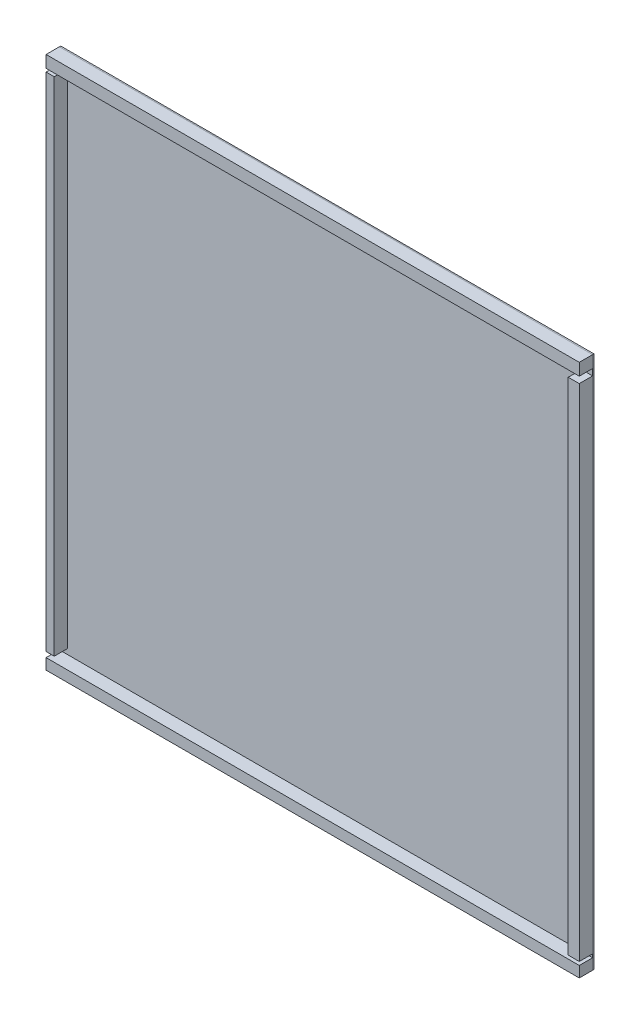
ISO-10303-21;
HEADER;
FILE_DESCRIPTION(('STEP AP214'),'2;1');
FILE_NAME('part.step','',(''),(''),'','','');
FILE_SCHEMA(('AUTOMOTIVE_DESIGN { 1 0 10303 214 1 1 1 1 }'));
ENDSEC;
DATA;
#1=APPLICATION_CONTEXT('core data for automotive mechanical design processes');
#2=APPLICATION_PROTOCOL_DEFINITION('international standard','automotive_design',2000,#1);
#3=PRODUCT_CONTEXT('',#1,'mechanical');
#4=PRODUCT('Part','Part','',(#3));
#5=PRODUCT_RELATED_PRODUCT_CATEGORY('part','',(#4));
#6=PRODUCT_DEFINITION_FORMATION('','',#4);
#7=PRODUCT_DEFINITION_CONTEXT('part definition',#1,'design');
#8=PRODUCT_DEFINITION('design','',#6,#7);
#9=PRODUCT_DEFINITION_SHAPE('','',#8);
#10=(LENGTH_UNIT() NAMED_UNIT(*) SI_UNIT(.MILLI.,.METRE.));
#11=(NAMED_UNIT(*) PLANE_ANGLE_UNIT() SI_UNIT($,.RADIAN.));
#12=(NAMED_UNIT(*) SI_UNIT($,.STERADIAN.) SOLID_ANGLE_UNIT());
#13=UNCERTAINTY_MEASURE_WITH_UNIT(LENGTH_MEASURE(1.E-05),#10,'distance_accuracy_value','');
#14=(GEOMETRIC_REPRESENTATION_CONTEXT(3) GLOBAL_UNCERTAINTY_ASSIGNED_CONTEXT((#13)) GLOBAL_UNIT_ASSIGNED_CONTEXT((#10,
#11,#12)) REPRESENTATION_CONTEXT('',''));
#15=CARTESIAN_POINT('',(0.,0.,0.));
#16=DIRECTION('',(0.,0.,1.));
#17=DIRECTION('',(1.,0.,0.));
#18=AXIS2_PLACEMENT_3D('',#15,#16,#17);
#19=CARTESIAN_POINT('',(-250.,3635.83819330735,110.));
#20=DIRECTION('',(1.,0.,0.));
#21=DIRECTION('',(0.,1.,0.));
#22=AXIS2_PLACEMENT_3D('',#19,#20,#21);
#23=PLANE('',#22);
#24=DIRECTION('',(0.,-1.,0.));
#25=VECTOR('',#24,1.);
#26=CARTESIAN_POINT('',(-250.,3635.83819330735,10.));
#27=LINE('',#26,#25);
#28=CARTESIAN_POINT('',(-250.,3635.83819330735,10.));
#29=VERTEX_POINT('',#28);
#30=CARTESIAN_POINT('',(-250.,-128.991405169124,10.));
#31=VERTEX_POINT('',#30);
#32=EDGE_CURVE('E111',#29,#31,#27,.T.);
#33=ORIENTED_EDGE('',*,*,#32,.T.);
#34=DIRECTION('',(0.,0.,-1.));
#35=VECTOR('',#34,1.);
#36=CARTESIAN_POINT('',(-250.,-128.991405169124,110.));
#37=LINE('',#36,#35);
#38=CARTESIAN_POINT('',(-250.,-128.991405169124,110.));
#39=VERTEX_POINT('',#38);
#40=EDGE_CURVE('E12',#39,#31,#37,.T.);
#41=ORIENTED_EDGE('',*,*,#40,.F.);
#42=DIRECTION('',(0.,-1.,0.));
#43=VECTOR('',#42,1.);
#44=CARTESIAN_POINT('',(-250.,3635.83819330735,110.));
#45=LINE('',#44,#43);
#46=CARTESIAN_POINT('',(-250.,3635.83819330735,110.));
#47=VERTEX_POINT('',#46);
#48=EDGE_CURVE('E99',#47,#39,#45,.T.);
#49=ORIENTED_EDGE('',*,*,#48,.F.);
#50=DIRECTION('',(0.,0.,-1.));
#51=VECTOR('',#50,1.);
#52=CARTESIAN_POINT('',(-250.,3635.83819330735,110.));
#53=LINE('',#52,#51);
#54=EDGE_CURVE('E107',#47,#29,#53,.T.);
#55=ORIENTED_EDGE('',*,*,#54,.T.);
#56=EDGE_LOOP('',(#33,#41,#49,#55));
#57=FACE_BOUND('',#56,.T.);
#58=ADVANCED_FACE('F48',(#57),#23,.F.);
#59=CARTESIAN_POINT('',(-250.,-128.991405169124,110.));
#60=DIRECTION('',(0.,1.,0.));
#61=DIRECTION('',(0.,0.,1.));
#62=AXIS2_PLACEMENT_3D('',#59,#60,#61);
#63=PLANE('',#62);
#64=DIRECTION('',(1.,0.,0.));
#65=VECTOR('',#64,1.);
#66=CARTESIAN_POINT('',(-250.,-128.991405169124,10.));
#67=LINE('',#66,#65);
#68=CARTESIAN_POINT('',(-188.991590886921,-128.991405169124,10.));
#69=VERTEX_POINT('',#68);
#70=EDGE_CURVE('E103',#31,#69,#67,.T.);
#71=ORIENTED_EDGE('',*,*,#70,.T.);
#72=DIRECTION('',(0.,0.,-1.));
#73=VECTOR('',#72,1.);
#74=CARTESIAN_POINT('',(-188.991590886921,-128.991405169124,110.));
#75=LINE('',#74,#73);
#76=CARTESIAN_POINT('',(-188.991590886921,-128.991405169124,110.));
#77=VERTEX_POINT('',#76);
#78=EDGE_CURVE('E56',#77,#69,#75,.T.);
#79=ORIENTED_EDGE('',*,*,#78,.F.);
#80=DIRECTION('',(1.,0.,0.));
#81=VECTOR('',#80,1.);
#82=CARTESIAN_POINT('',(-250.,-128.991405169124,110.));
#83=LINE('',#82,#81);
#84=EDGE_CURVE('E94',#39,#77,#83,.T.);
#85=ORIENTED_EDGE('',*,*,#84,.F.);
#86=ORIENTED_EDGE('',*,*,#40,.T.);
#87=EDGE_LOOP('',(#71,#79,#85,#86));
#88=FACE_BOUND('',#87,.T.);
#89=ADVANCED_FACE('F102',(#88),#63,.F.);
#90=CARTESIAN_POINT('',(-188.991590886921,3635.83819330735,110.));
#91=DIRECTION('',(-1.,0.,0.));
#92=DIRECTION('',(0.,-1.,0.));
#93=AXIS2_PLACEMENT_3D('',#90,#91,#92);
#94=PLANE('',#93);
#95=DIRECTION('',(0.,1.,0.));
#96=VECTOR('',#95,1.);
#97=CARTESIAN_POINT('',(-188.991590886921,3635.83819330735,10.));
#98=LINE('',#97,#96);
#99=CARTESIAN_POINT('',(-188.991590886921,3635.83819330735,10.));
#100=VERTEX_POINT('',#99);
#101=EDGE_CURVE('E81',#69,#100,#98,.T.);
#102=ORIENTED_EDGE('',*,*,#101,.T.);
#103=DIRECTION('',(0.,0.,-1.));
#104=VECTOR('',#103,1.);
#105=CARTESIAN_POINT('',(-188.991590886921,3635.83819330735,110.));
#106=LINE('',#105,#104);
#107=CARTESIAN_POINT('',(-188.991590886921,3635.83819330735,110.));
#108=VERTEX_POINT('',#107);
#109=EDGE_CURVE('E104',#108,#100,#106,.T.);
#110=ORIENTED_EDGE('',*,*,#109,.F.);
#111=DIRECTION('',(0.,1.,0.));
#112=VECTOR('',#111,1.);
#113=CARTESIAN_POINT('',(-188.991590886921,3635.83819330735,110.));
#114=LINE('',#113,#112);
#115=EDGE_CURVE('E97',#77,#108,#114,.T.);
#116=ORIENTED_EDGE('',*,*,#115,.F.);
#117=ORIENTED_EDGE('',*,*,#78,.T.);
#118=EDGE_LOOP('',(#102,#110,#116,#117));
#119=FACE_BOUND('',#118,.T.);
#120=ADVANCED_FACE('F105',(#119),#94,.F.);
#121=CARTESIAN_POINT('',(-250.,3635.83819330735,110.));
#122=DIRECTION('',(0.,-1.,0.));
#123=DIRECTION('',(0.,0.,-1.));
#124=AXIS2_PLACEMENT_3D('',#121,#122,#123);
#125=PLANE('',#124);
#126=DIRECTION('',(-1.,0.,0.));
#127=VECTOR('',#126,1.);
#128=CARTESIAN_POINT('',(-250.,3635.83819330735,10.));
#129=LINE('',#128,#127);
#130=EDGE_CURVE('E87',#100,#29,#129,.T.);
#131=ORIENTED_EDGE('',*,*,#130,.T.);
#132=ORIENTED_EDGE('',*,*,#54,.F.);
#133=DIRECTION('',(-1.,0.,0.));
#134=VECTOR('',#133,1.);
#135=CARTESIAN_POINT('',(-250.,3635.83819330735,110.));
#136=LINE('',#135,#134);
#137=EDGE_CURVE('E64',#108,#47,#136,.T.);
#138=ORIENTED_EDGE('',*,*,#137,.F.);
#139=ORIENTED_EDGE('',*,*,#109,.T.);
#140=EDGE_LOOP('',(#131,#132,#138,#139));
#141=FACE_BOUND('',#140,.T.);
#142=ADVANCED_FACE('F118',(#141),#125,.F.);
#143=CARTESIAN_POINT('',(0.,0.,110.));
#144=DIRECTION('',(0.,0.,1.));
#145=DIRECTION('',(1.,0.,0.));
#146=AXIS2_PLACEMENT_3D('',#143,#144,#145);
#147=PLANE('',#146);
#148=ORIENTED_EDGE('',*,*,#48,.T.);
#149=ORIENTED_EDGE('',*,*,#84,.T.);
#150=ORIENTED_EDGE('',*,*,#115,.T.);
#151=ORIENTED_EDGE('',*,*,#137,.T.);
#152=EDGE_LOOP('',(#148,#149,#150,#151));
#153=FACE_BOUND('',#152,.T.);
#154=ADVANCED_FACE('F95',(#153),#147,.T.);
#155=CARTESIAN_POINT('',(0.,0.,10.));
#156=DIRECTION('',(0.,0.,1.));
#157=DIRECTION('',(1.,0.,0.));
#158=AXIS2_PLACEMENT_3D('',#155,#156,#157);
#159=PLANE('',#158);
#160=ORIENTED_EDGE('',*,*,#32,.F.);
#161=ORIENTED_EDGE('',*,*,#130,.F.);
#162=ORIENTED_EDGE('',*,*,#101,.F.);
#163=ORIENTED_EDGE('',*,*,#70,.F.);
#164=EDGE_LOOP('',(#160,#161,#162,#163));
#165=FACE_BOUND('',#164,.T.);
#166=ADVANCED_FACE('F121',(#165),#159,.F.);
#167=CLOSED_SHELL('',(#58,#89,#120,#142,#154,#166));
#168=MANIFOLD_SOLID_BREP('B2',#167);
#169=CARTESIAN_POINT('',(3750.,3611.65891163353,110.));
#170=DIRECTION('',(-1.,0.,0.));
#171=DIRECTION('',(0.,0.,1.));
#172=AXIS2_PLACEMENT_3D('',#169,#170,#171);
#173=PLANE('',#172);
#174=DIRECTION('',(0.,1.,0.));
#175=VECTOR('',#174,1.);
#176=CARTESIAN_POINT('',(3750.,3611.65891163353,10.));
#177=LINE('',#176,#175);
#178=CARTESIAN_POINT('',(3750.,-142.873459851821,10.));
#179=VERTEX_POINT('',#178);
#180=CARTESIAN_POINT('',(3750.,3611.65891163353,10.));
#181=VERTEX_POINT('',#180);
#182=EDGE_CURVE('E245',#179,#181,#177,.T.);
#183=ORIENTED_EDGE('',*,*,#182,.T.);
#184=DIRECTION('',(0.,0.,-1.));
#185=VECTOR('',#184,1.);
#186=CARTESIAN_POINT('',(3750.,3611.65891163353,110.));
#187=LINE('',#186,#185);
#188=CARTESIAN_POINT('',(3750.,3611.65891163353,110.));
#189=VERTEX_POINT('',#188);
#190=EDGE_CURVE('E46',#189,#181,#187,.T.);
#191=ORIENTED_EDGE('',*,*,#190,.F.);
#192=DIRECTION('',(0.,1.,0.));
#193=VECTOR('',#192,1.);
#194=CARTESIAN_POINT('',(3750.,3611.65891163353,110.));
#195=LINE('',#194,#193);
#196=CARTESIAN_POINT('',(3750.,-142.873459851821,110.));
#197=VERTEX_POINT('',#196);
#198=EDGE_CURVE('E233',#197,#189,#195,.T.);
#199=ORIENTED_EDGE('',*,*,#198,.F.);
#200=DIRECTION('',(0.,0.,-1.));
#201=VECTOR('',#200,1.);
#202=CARTESIAN_POINT('',(3750.,-142.873459851821,110.));
#203=LINE('',#202,#201);
#204=EDGE_CURVE('E241',#197,#179,#203,.T.);
#205=ORIENTED_EDGE('',*,*,#204,.T.);
#206=EDGE_LOOP('',(#183,#191,#199,#205));
#207=FACE_BOUND('',#206,.T.);
#208=ADVANCED_FACE('F182',(#207),#173,.F.);
#209=CARTESIAN_POINT('',(3750.,3611.65891163353,110.));
#210=DIRECTION('',(0.,-1.,0.));
#211=DIRECTION('',(0.,0.,-1.));
#212=AXIS2_PLACEMENT_3D('',#209,#210,#211);
#213=PLANE('',#212);
#214=DIRECTION('',(-1.,0.,0.));
#215=VECTOR('',#214,1.);
#216=CARTESIAN_POINT('',(3750.,3611.65891163353,10.));
#217=LINE('',#216,#215);
#218=CARTESIAN_POINT('',(3667.29530272277,3611.65891163353,10.));
#219=VERTEX_POINT('',#218);
#220=EDGE_CURVE('E237',#181,#219,#217,.T.);
#221=ORIENTED_EDGE('',*,*,#220,.T.);
#222=DIRECTION('',(0.,0.,-1.));
#223=VECTOR('',#222,1.);
#224=CARTESIAN_POINT('',(3667.29530272277,3611.65891163353,110.));
#225=LINE('',#224,#223);
#226=CARTESIAN_POINT('',(3667.29530272277,3611.65891163353,110.));
#227=VERTEX_POINT('',#226);
#228=EDGE_CURVE('E190',#227,#219,#225,.T.);
#229=ORIENTED_EDGE('',*,*,#228,.F.);
#230=DIRECTION('',(-1.,0.,0.));
#231=VECTOR('',#230,1.);
#232=CARTESIAN_POINT('',(3750.,3611.65891163353,110.));
#233=LINE('',#232,#231);
#234=EDGE_CURVE('E228',#189,#227,#233,.T.);
#235=ORIENTED_EDGE('',*,*,#234,.F.);
#236=ORIENTED_EDGE('',*,*,#190,.T.);
#237=EDGE_LOOP('',(#221,#229,#235,#236));
#238=FACE_BOUND('',#237,.T.);
#239=ADVANCED_FACE('F236',(#238),#213,.F.);
#240=CARTESIAN_POINT('',(3667.29530272277,3611.65891163353,110.));
#241=DIRECTION('',(1.,0.,0.));
#242=DIRECTION('',(0.,1.,0.));
#243=AXIS2_PLACEMENT_3D('',#240,#241,#242);
#244=PLANE('',#243);
#245=DIRECTION('',(0.,-1.,0.));
#246=VECTOR('',#245,1.);
#247=CARTESIAN_POINT('',(3667.29530272277,3611.65891163353,10.));
#248=LINE('',#247,#246);
#249=CARTESIAN_POINT('',(3667.29530272277,-142.873459851821,10.));
#250=VERTEX_POINT('',#249);
#251=EDGE_CURVE('E215',#219,#250,#248,.T.);
#252=ORIENTED_EDGE('',*,*,#251,.T.);
#253=DIRECTION('',(0.,0.,-1.));
#254=VECTOR('',#253,1.);
#255=CARTESIAN_POINT('',(3667.29530272277,-142.873459851821,110.));
#256=LINE('',#255,#254);
#257=CARTESIAN_POINT('',(3667.29530272277,-142.873459851821,110.));
#258=VERTEX_POINT('',#257);
#259=EDGE_CURVE('E238',#258,#250,#256,.T.);
#260=ORIENTED_EDGE('',*,*,#259,.F.);
#261=DIRECTION('',(0.,-1.,0.));
#262=VECTOR('',#261,1.);
#263=CARTESIAN_POINT('',(3667.29530272277,3611.65891163353,110.));
#264=LINE('',#263,#262);
#265=EDGE_CURVE('E231',#227,#258,#264,.T.);
#266=ORIENTED_EDGE('',*,*,#265,.F.);
#267=ORIENTED_EDGE('',*,*,#228,.T.);
#268=EDGE_LOOP('',(#252,#260,#266,#267));
#269=FACE_BOUND('',#268,.T.);
#270=ADVANCED_FACE('F239',(#269),#244,.F.);
#271=CARTESIAN_POINT('',(3750.,-142.873459851821,110.));
#272=DIRECTION('',(0.,1.,0.));
#273=DIRECTION('',(0.,0.,1.));
#274=AXIS2_PLACEMENT_3D('',#271,#272,#273);
#275=PLANE('',#274);
#276=DIRECTION('',(1.,0.,0.));
#277=VECTOR('',#276,1.);
#278=CARTESIAN_POINT('',(3750.,-142.873459851821,10.));
#279=LINE('',#278,#277);
#280=EDGE_CURVE('E221',#250,#179,#279,.T.);
#281=ORIENTED_EDGE('',*,*,#280,.T.);
#282=ORIENTED_EDGE('',*,*,#204,.F.);
#283=DIRECTION('',(1.,0.,0.));
#284=VECTOR('',#283,1.);
#285=CARTESIAN_POINT('',(3750.,-142.873459851821,110.));
#286=LINE('',#285,#284);
#287=EDGE_CURVE('E198',#258,#197,#286,.T.);
#288=ORIENTED_EDGE('',*,*,#287,.F.);
#289=ORIENTED_EDGE('',*,*,#259,.T.);
#290=EDGE_LOOP('',(#281,#282,#288,#289));
#291=FACE_BOUND('',#290,.T.);
#292=ADVANCED_FACE('F252',(#291),#275,.F.);
#293=CARTESIAN_POINT('',(0.,0.,110.));
#294=DIRECTION('',(0.,0.,-1.));
#295=DIRECTION('',(-1.,0.,0.));
#296=AXIS2_PLACEMENT_3D('',#293,#294,#295);
#297=PLANE('',#296);
#298=ORIENTED_EDGE('',*,*,#198,.T.);
#299=ORIENTED_EDGE('',*,*,#234,.T.);
#300=ORIENTED_EDGE('',*,*,#265,.T.);
#301=ORIENTED_EDGE('',*,*,#287,.T.);
#302=EDGE_LOOP('',(#298,#299,#300,#301));
#303=FACE_BOUND('',#302,.T.);
#304=ADVANCED_FACE('F229',(#303),#297,.F.);
#305=CARTESIAN_POINT('',(0.,0.,10.));
#306=DIRECTION('',(0.,0.,-1.));
#307=DIRECTION('',(-1.,0.,0.));
#308=AXIS2_PLACEMENT_3D('',#305,#306,#307);
#309=PLANE('',#308);
#310=ORIENTED_EDGE('',*,*,#182,.F.);
#311=ORIENTED_EDGE('',*,*,#280,.F.);
#312=ORIENTED_EDGE('',*,*,#251,.F.);
#313=ORIENTED_EDGE('',*,*,#220,.F.);
#314=EDGE_LOOP('',(#310,#311,#312,#313));
#315=FACE_BOUND('',#314,.T.);
#316=ADVANCED_FACE('F255',(#315),#309,.T.);
#317=CLOSED_SHELL('',(#208,#239,#270,#292,#304,#316));
#318=MANIFOLD_SOLID_BREP('B6',#317);
#319=CARTESIAN_POINT('',(3750.,-250.,110.));
#320=DIRECTION('',(-1.,0.,0.));
#321=DIRECTION('',(0.,0.,1.));
#322=AXIS2_PLACEMENT_3D('',#319,#320,#321);
#323=PLANE('',#322);
#324=DIRECTION('',(0.,1.,0.));
#325=VECTOR('',#324,1.);
#326=CARTESIAN_POINT('',(3750.,-250.,10.));
#327=LINE('',#326,#325);
#328=CARTESIAN_POINT('',(3750.,-250.,10.));
#329=VERTEX_POINT('',#328);
#330=CARTESIAN_POINT('',(3750.,-168.414891018658,10.));
#331=VERTEX_POINT('',#330);
#332=EDGE_CURVE('E379',#329,#331,#327,.T.);
#333=ORIENTED_EDGE('',*,*,#332,.T.);
#334=DIRECTION('',(0.,0.,-1.));
#335=VECTOR('',#334,1.);
#336=CARTESIAN_POINT('',(3750.,-168.414891018658,110.));
#337=LINE('',#336,#335);
#338=CARTESIAN_POINT('',(3750.,-168.414891018658,110.));
#339=VERTEX_POINT('',#338);
#340=EDGE_CURVE('E180',#339,#331,#337,.T.);
#341=ORIENTED_EDGE('',*,*,#340,.F.);
#342=DIRECTION('',(0.,1.,0.));
#343=VECTOR('',#342,1.);
#344=CARTESIAN_POINT('',(3750.,-250.,110.));
#345=LINE('',#344,#343);
#346=CARTESIAN_POINT('',(3750.,-250.,110.));
#347=VERTEX_POINT('',#346);
#348=EDGE_CURVE('E367',#347,#339,#345,.T.);
#349=ORIENTED_EDGE('',*,*,#348,.F.);
#350=DIRECTION('',(0.,0.,-1.));
#351=VECTOR('',#350,1.);
#352=CARTESIAN_POINT('',(3750.,-250.,110.));
#353=LINE('',#352,#351);
#354=EDGE_CURVE('E375',#347,#329,#353,.T.);
#355=ORIENTED_EDGE('',*,*,#354,.T.);
#356=EDGE_LOOP('',(#333,#341,#349,#355));
#357=FACE_BOUND('',#356,.T.);
#358=ADVANCED_FACE('F316',(#357),#323,.F.);
#359=CARTESIAN_POINT('',(3750.,-168.414891018658,110.));
#360=DIRECTION('',(0.,-1.,0.));
#361=DIRECTION('',(1.,0.,0.));
#362=AXIS2_PLACEMENT_3D('',#359,#360,#361);
#363=PLANE('',#362);
#364=DIRECTION('',(-1.,0.,0.));
#365=VECTOR('',#364,1.);
#366=CARTESIAN_POINT('',(3750.,-168.414891018658,10.));
#367=LINE('',#366,#365);
#368=CARTESIAN_POINT('',(-250.,-168.414891018658,10.));
#369=VERTEX_POINT('',#368);
#370=EDGE_CURVE('E371',#331,#369,#367,.T.);
#371=ORIENTED_EDGE('',*,*,#370,.T.);
#372=DIRECTION('',(0.,0.,-1.));
#373=VECTOR('',#372,1.);
#374=CARTESIAN_POINT('',(-250.,-168.414891018658,110.));
#375=LINE('',#374,#373);
#376=CARTESIAN_POINT('',(-250.,-168.414891018658,110.));
#377=VERTEX_POINT('',#376);
#378=EDGE_CURVE('E324',#377,#369,#375,.T.);
#379=ORIENTED_EDGE('',*,*,#378,.F.);
#380=DIRECTION('',(-1.,0.,0.));
#381=VECTOR('',#380,1.);
#382=CARTESIAN_POINT('',(3750.,-168.414891018658,110.));
#383=LINE('',#382,#381);
#384=EDGE_CURVE('E362',#339,#377,#383,.T.);
#385=ORIENTED_EDGE('',*,*,#384,.F.);
#386=ORIENTED_EDGE('',*,*,#340,.T.);
#387=EDGE_LOOP('',(#371,#379,#385,#386));
#388=FACE_BOUND('',#387,.T.);
#389=ADVANCED_FACE('F370',(#388),#363,.F.);
#390=CARTESIAN_POINT('',(-250.,-250.,110.));
#391=DIRECTION('',(1.,0.,0.));
#392=DIRECTION('',(0.,1.,0.));
#393=AXIS2_PLACEMENT_3D('',#390,#391,#392);
#394=PLANE('',#393);
#395=DIRECTION('',(0.,-1.,0.));
#396=VECTOR('',#395,1.);
#397=CARTESIAN_POINT('',(-250.,-250.,10.));
#398=LINE('',#397,#396);
#399=CARTESIAN_POINT('',(-250.,-250.,10.));
#400=VERTEX_POINT('',#399);
#401=EDGE_CURVE('E349',#369,#400,#398,.T.);
#402=ORIENTED_EDGE('',*,*,#401,.T.);
#403=DIRECTION('',(0.,0.,-1.));
#404=VECTOR('',#403,1.);
#405=CARTESIAN_POINT('',(-250.,-250.,110.));
#406=LINE('',#405,#404);
#407=CARTESIAN_POINT('',(-250.,-250.,110.));
#408=VERTEX_POINT('',#407);
#409=EDGE_CURVE('E372',#408,#400,#406,.T.);
#410=ORIENTED_EDGE('',*,*,#409,.F.);
#411=DIRECTION('',(0.,-1.,0.));
#412=VECTOR('',#411,1.);
#413=CARTESIAN_POINT('',(-250.,-250.,110.));
#414=LINE('',#413,#412);
#415=EDGE_CURVE('E365',#377,#408,#414,.T.);
#416=ORIENTED_EDGE('',*,*,#415,.F.);
#417=ORIENTED_EDGE('',*,*,#378,.T.);
#418=EDGE_LOOP('',(#402,#410,#416,#417));
#419=FACE_BOUND('',#418,.T.);
#420=ADVANCED_FACE('F373',(#419),#394,.F.);
#421=CARTESIAN_POINT('',(3750.,-250.,110.));
#422=DIRECTION('',(0.,1.,0.));
#423=DIRECTION('',(-1.,0.,0.));
#424=AXIS2_PLACEMENT_3D('',#421,#422,#423);
#425=PLANE('',#424);
#426=DIRECTION('',(1.,0.,0.));
#427=VECTOR('',#426,1.);
#428=CARTESIAN_POINT('',(3750.,-250.,10.));
#429=LINE('',#428,#427);
#430=EDGE_CURVE('E355',#400,#329,#429,.T.);
#431=ORIENTED_EDGE('',*,*,#430,.T.);
#432=ORIENTED_EDGE('',*,*,#354,.F.);
#433=DIRECTION('',(1.,0.,0.));
#434=VECTOR('',#433,1.);
#435=CARTESIAN_POINT('',(3750.,-250.,110.));
#436=LINE('',#435,#434);
#437=EDGE_CURVE('E332',#408,#347,#436,.T.);
#438=ORIENTED_EDGE('',*,*,#437,.F.);
#439=ORIENTED_EDGE('',*,*,#409,.T.);
#440=EDGE_LOOP('',(#431,#432,#438,#439));
#441=FACE_BOUND('',#440,.T.);
#442=ADVANCED_FACE('F386',(#441),#425,.F.);
#443=CARTESIAN_POINT('',(0.,0.,110.));
#444=DIRECTION('',(0.,0.,1.));
#445=DIRECTION('',(1.,0.,0.));
#446=AXIS2_PLACEMENT_3D('',#443,#444,#445);
#447=PLANE('',#446);
#448=ORIENTED_EDGE('',*,*,#348,.T.);
#449=ORIENTED_EDGE('',*,*,#384,.T.);
#450=ORIENTED_EDGE('',*,*,#415,.T.);
#451=ORIENTED_EDGE('',*,*,#437,.T.);
#452=EDGE_LOOP('',(#448,#449,#450,#451));
#453=FACE_BOUND('',#452,.T.);
#454=ADVANCED_FACE('F363',(#453),#447,.T.);
#455=CARTESIAN_POINT('',(0.,0.,10.));
#456=DIRECTION('',(0.,0.,1.));
#457=DIRECTION('',(1.,0.,0.));
#458=AXIS2_PLACEMENT_3D('',#455,#456,#457);
#459=PLANE('',#458);
#460=ORIENTED_EDGE('',*,*,#332,.F.);
#461=ORIENTED_EDGE('',*,*,#430,.F.);
#462=ORIENTED_EDGE('',*,*,#401,.F.);
#463=ORIENTED_EDGE('',*,*,#370,.F.);
#464=EDGE_LOOP('',(#460,#461,#462,#463));
#465=FACE_BOUND('',#464,.T.);
#466=ADVANCED_FACE('F389',(#465),#459,.F.);
#467=CLOSED_SHELL('',(#358,#389,#420,#442,#454,#466));
#468=MANIFOLD_SOLID_BREP('B40',#467);
#469=CARTESIAN_POINT('',(-250.,3750.,110.));
#470=DIRECTION('',(1.,0.,0.));
#471=DIRECTION('',(0.,0.,-1.));
#472=AXIS2_PLACEMENT_3D('',#469,#470,#471);
#473=PLANE('',#472);
#474=DIRECTION('',(0.,-1.,0.));
#475=VECTOR('',#474,1.);
#476=CARTESIAN_POINT('',(-250.,3750.,10.));
#477=LINE('',#476,#475);
#478=CARTESIAN_POINT('',(-250.,3750.,10.));
#479=VERTEX_POINT('',#478);
#480=CARTESIAN_POINT('',(-250.,3659.87592745532,10.));
#481=VERTEX_POINT('',#480);
#482=EDGE_CURVE('E513',#479,#481,#477,.T.);
#483=ORIENTED_EDGE('',*,*,#482,.T.);
#484=DIRECTION('',(0.,0.,-1.));
#485=VECTOR('',#484,1.);
#486=CARTESIAN_POINT('',(-250.,3659.87592745532,110.));
#487=LINE('',#486,#485);
#488=CARTESIAN_POINT('',(-250.,3659.87592745532,110.));
#489=VERTEX_POINT('',#488);
#490=EDGE_CURVE('E314',#489,#481,#487,.T.);
#491=ORIENTED_EDGE('',*,*,#490,.F.);
#492=DIRECTION('',(0.,-1.,0.));
#493=VECTOR('',#492,1.);
#494=CARTESIAN_POINT('',(-250.,3750.,110.));
#495=LINE('',#494,#493);
#496=CARTESIAN_POINT('',(-250.,3750.,110.));
#497=VERTEX_POINT('',#496);
#498=EDGE_CURVE('E501',#497,#489,#495,.T.);
#499=ORIENTED_EDGE('',*,*,#498,.F.);
#500=DIRECTION('',(0.,0.,-1.));
#501=VECTOR('',#500,1.);
#502=CARTESIAN_POINT('',(-250.,3750.,110.));
#503=LINE('',#502,#501);
#504=EDGE_CURVE('E509',#497,#479,#503,.T.);
#505=ORIENTED_EDGE('',*,*,#504,.T.);
#506=EDGE_LOOP('',(#483,#491,#499,#505));
#507=FACE_BOUND('',#506,.T.);
#508=ADVANCED_FACE('F450',(#507),#473,.F.);
#509=CARTESIAN_POINT('',(-250.,3659.87592745532,110.));
#510=DIRECTION('',(0.,1.,0.));
#511=DIRECTION('',(0.,0.,1.));
#512=AXIS2_PLACEMENT_3D('',#509,#510,#511);
#513=PLANE('',#512);
#514=DIRECTION('',(1.,0.,0.));
#515=VECTOR('',#514,1.);
#516=CARTESIAN_POINT('',(-250.,3659.87592745532,10.));
#517=LINE('',#516,#515);
#518=CARTESIAN_POINT('',(3750.,3659.87592745532,10.));
#519=VERTEX_POINT('',#518);
#520=EDGE_CURVE('E505',#481,#519,#517,.T.);
#521=ORIENTED_EDGE('',*,*,#520,.T.);
#522=DIRECTION('',(0.,0.,-1.));
#523=VECTOR('',#522,1.);
#524=CARTESIAN_POINT('',(3750.,3659.87592745532,110.));
#525=LINE('',#524,#523);
#526=CARTESIAN_POINT('',(3750.,3659.87592745532,110.));
#527=VERTEX_POINT('',#526);
#528=EDGE_CURVE('E458',#527,#519,#525,.T.);
#529=ORIENTED_EDGE('',*,*,#528,.F.);
#530=DIRECTION('',(1.,0.,0.));
#531=VECTOR('',#530,1.);
#532=CARTESIAN_POINT('',(-250.,3659.87592745532,110.));
#533=LINE('',#532,#531);
#534=EDGE_CURVE('E496',#489,#527,#533,.T.);
#535=ORIENTED_EDGE('',*,*,#534,.F.);
#536=ORIENTED_EDGE('',*,*,#490,.T.);
#537=EDGE_LOOP('',(#521,#529,#535,#536));
#538=FACE_BOUND('',#537,.T.);
#539=ADVANCED_FACE('F504',(#538),#513,.F.);
#540=CARTESIAN_POINT('',(3750.,3750.,110.));
#541=DIRECTION('',(-1.,0.,0.));
#542=DIRECTION('',(0.,0.,1.));
#543=AXIS2_PLACEMENT_3D('',#540,#541,#542);
#544=PLANE('',#543);
#545=DIRECTION('',(0.,1.,0.));
#546=VECTOR('',#545,1.);
#547=CARTESIAN_POINT('',(3750.,3750.,10.));
#548=LINE('',#547,#546);
#549=CARTESIAN_POINT('',(3750.,3750.,10.));
#550=VERTEX_POINT('',#549);
#551=EDGE_CURVE('E483',#519,#550,#548,.T.);
#552=ORIENTED_EDGE('',*,*,#551,.T.);
#553=DIRECTION('',(0.,0.,-1.));
#554=VECTOR('',#553,1.);
#555=CARTESIAN_POINT('',(3750.,3750.,110.));
#556=LINE('',#555,#554);
#557=CARTESIAN_POINT('',(3750.,3750.,110.));
#558=VERTEX_POINT('',#557);
#559=EDGE_CURVE('E506',#558,#550,#556,.T.);
#560=ORIENTED_EDGE('',*,*,#559,.F.);
#561=DIRECTION('',(0.,1.,0.));
#562=VECTOR('',#561,1.);
#563=CARTESIAN_POINT('',(3750.,3750.,110.));
#564=LINE('',#563,#562);
#565=EDGE_CURVE('E499',#527,#558,#564,.T.);
#566=ORIENTED_EDGE('',*,*,#565,.F.);
#567=ORIENTED_EDGE('',*,*,#528,.T.);
#568=EDGE_LOOP('',(#552,#560,#566,#567));
#569=FACE_BOUND('',#568,.T.);
#570=ADVANCED_FACE('F507',(#569),#544,.F.);
#571=CARTESIAN_POINT('',(-250.,3750.,110.));
#572=DIRECTION('',(0.,-1.,0.));
#573=DIRECTION('',(0.,0.,-1.));
#574=AXIS2_PLACEMENT_3D('',#571,#572,#573);
#575=PLANE('',#574);
#576=DIRECTION('',(-1.,0.,0.));
#577=VECTOR('',#576,1.);
#578=CARTESIAN_POINT('',(-250.,3750.,10.));
#579=LINE('',#578,#577);
#580=EDGE_CURVE('E489',#550,#479,#579,.T.);
#581=ORIENTED_EDGE('',*,*,#580,.T.);
#582=ORIENTED_EDGE('',*,*,#504,.F.);
#583=DIRECTION('',(-1.,0.,0.));
#584=VECTOR('',#583,1.);
#585=CARTESIAN_POINT('',(-250.,3750.,110.));
#586=LINE('',#585,#584);
#587=EDGE_CURVE('E466',#558,#497,#586,.T.);
#588=ORIENTED_EDGE('',*,*,#587,.F.);
#589=ORIENTED_EDGE('',*,*,#559,.T.);
#590=EDGE_LOOP('',(#581,#582,#588,#589));
#591=FACE_BOUND('',#590,.T.);
#592=ADVANCED_FACE('F520',(#591),#575,.F.);
#593=CARTESIAN_POINT('',(0.,0.,110.));
#594=DIRECTION('',(0.,0.,1.));
#595=DIRECTION('',(1.,0.,0.));
#596=AXIS2_PLACEMENT_3D('',#593,#594,#595);
#597=PLANE('',#596);
#598=ORIENTED_EDGE('',*,*,#498,.T.);
#599=ORIENTED_EDGE('',*,*,#534,.T.);
#600=ORIENTED_EDGE('',*,*,#565,.T.);
#601=ORIENTED_EDGE('',*,*,#587,.T.);
#602=EDGE_LOOP('',(#598,#599,#600,#601));
#603=FACE_BOUND('',#602,.T.);
#604=ADVANCED_FACE('F497',(#603),#597,.T.);
#605=CARTESIAN_POINT('',(0.,0.,10.));
#606=DIRECTION('',(0.,0.,1.));
#607=DIRECTION('',(1.,0.,0.));
#608=AXIS2_PLACEMENT_3D('',#605,#606,#607);
#609=PLANE('',#608);
#610=ORIENTED_EDGE('',*,*,#482,.F.);
#611=ORIENTED_EDGE('',*,*,#580,.F.);
#612=ORIENTED_EDGE('',*,*,#551,.F.);
#613=ORIENTED_EDGE('',*,*,#520,.F.);
#614=EDGE_LOOP('',(#610,#611,#612,#613));
#615=FACE_BOUND('',#614,.T.);
#616=ADVANCED_FACE('F523',(#615),#609,.F.);
#617=CLOSED_SHELL('',(#508,#539,#570,#592,#604,#616));
#618=MANIFOLD_SOLID_BREP('B174',#617);
#619=CARTESIAN_POINT('',(0.,0.,0.));
#620=DIRECTION('',(0.,0.,1.));
#621=DIRECTION('',(1.,0.,0.));
#622=AXIS2_PLACEMENT_3D('',#619,#620,#621);
#623=PLANE('',#622);
#624=DIRECTION('',(0.,1.,0.));
#625=VECTOR('',#624,1.);
#626=CARTESIAN_POINT('',(-250.,3750.,0.));
#627=LINE('',#626,#625);
#628=CARTESIAN_POINT('',(-250.,-250.,-1.13686837721616E-10));
#629=VERTEX_POINT('',#628);
#630=CARTESIAN_POINT('',(-250.,3750.,-1.13686837721616E-10));
#631=VERTEX_POINT('',#630);
#632=EDGE_CURVE('E629',#629,#631,#627,.T.);
#633=ORIENTED_EDGE('',*,*,#632,.T.);
#634=DIRECTION('',(-1.,0.,0.));
#635=VECTOR('',#634,1.);
#636=CARTESIAN_POINT('',(-250.,3750.,0.));
#637=LINE('',#636,#635);
#638=CARTESIAN_POINT('',(3750.,3750.,-1.13686837721616E-10));
#639=VERTEX_POINT('',#638);
#640=EDGE_CURVE('E644',#639,#631,#637,.T.);
#641=ORIENTED_EDGE('',*,*,#640,.F.);
#642=DIRECTION('',(0.,1.,0.));
#643=VECTOR('',#642,1.);
#644=CARTESIAN_POINT('',(3750.,3750.,0.));
#645=LINE('',#644,#643);
#646=CARTESIAN_POINT('',(3750.,-250.,-1.13686837721616E-10));
#647=VERTEX_POINT('',#646);
#648=EDGE_CURVE('E630',#647,#639,#645,.T.);
#649=ORIENTED_EDGE('',*,*,#648,.F.);
#650=DIRECTION('',(1.,0.,0.));
#651=VECTOR('',#650,1.);
#652=CARTESIAN_POINT('',(-250.,-250.,0.));
#653=LINE('',#652,#651);
#654=EDGE_CURVE('E627',#629,#647,#653,.T.);
#655=ORIENTED_EDGE('',*,*,#654,.F.);
#656=EDGE_LOOP('',(#633,#641,#649,#655));
#657=FACE_BOUND('',#656,.T.);
#658=ADVANCED_FACE('F583',(#657),#623,.F.);
#659=CARTESIAN_POINT('',(3750.,3750.,-500000.));
#660=DIRECTION('',(1.,0.,0.));
#661=DIRECTION('',(0.,1.,0.));
#662=AXIS2_PLACEMENT_3D('',#659,#660,#661);
#663=PLANE('',#662);
#664=DIRECTION('',(0.,0.,1.));
#665=VECTOR('',#664,1.);
#666=CARTESIAN_POINT('',(3750.,-250.,-500000.));
#667=LINE('',#666,#665);
#668=CARTESIAN_POINT('',(3750.,-250.,10.));
#669=VERTEX_POINT('',#668);
#670=EDGE_CURVE('E643',#647,#669,#667,.T.);
#671=ORIENTED_EDGE('',*,*,#670,.F.);
#672=ORIENTED_EDGE('',*,*,#648,.T.);
#673=DIRECTION('',(0.,0.,1.));
#674=VECTOR('',#673,1.);
#675=CARTESIAN_POINT('',(3750.,3750.,-500000.));
#676=LINE('',#675,#674);
#677=CARTESIAN_POINT('',(3750.,3750.,10.));
#678=VERTEX_POINT('',#677);
#679=EDGE_CURVE('E607',#639,#678,#676,.T.);
#680=ORIENTED_EDGE('',*,*,#679,.T.);
#681=DIRECTION('',(0.,1.,0.));
#682=VECTOR('',#681,1.);
#683=CARTESIAN_POINT('',(3750.,3750.,10.));
#684=LINE('',#683,#682);
#685=EDGE_CURVE('E649',#669,#678,#684,.T.);
#686=ORIENTED_EDGE('',*,*,#685,.F.);
#687=EDGE_LOOP('',(#671,#672,#680,#686));
#688=FACE_BOUND('',#687,.T.);
#689=ADVANCED_FACE('F656',(#688),#663,.T.);
#690=CARTESIAN_POINT('',(0.,0.,10.));
#691=DIRECTION('',(0.,0.,1.));
#692=DIRECTION('',(1.,0.,0.));
#693=AXIS2_PLACEMENT_3D('',#690,#691,#692);
#694=PLANE('',#693);
#695=DIRECTION('',(0.,-1.,0.));
#696=VECTOR('',#695,1.);
#697=CARTESIAN_POINT('',(-250.,3750.,10.));
#698=LINE('',#697,#696);
#699=CARTESIAN_POINT('',(-250.,3750.,10.));
#700=VERTEX_POINT('',#699);
#701=CARTESIAN_POINT('',(-250.,-250.,10.));
#702=VERTEX_POINT('',#701);
#703=EDGE_CURVE('E448',#700,#702,#698,.T.);
#704=ORIENTED_EDGE('',*,*,#703,.T.);
#705=DIRECTION('',(1.,0.,0.));
#706=VECTOR('',#705,1.);
#707=CARTESIAN_POINT('',(-250.,-250.,10.));
#708=LINE('',#707,#706);
#709=EDGE_CURVE('E592',#702,#669,#708,.T.);
#710=ORIENTED_EDGE('',*,*,#709,.T.);
#711=ORIENTED_EDGE('',*,*,#685,.T.);
#712=DIRECTION('',(-1.,0.,0.));
#713=VECTOR('',#712,1.);
#714=CARTESIAN_POINT('',(-250.,3750.,10.));
#715=LINE('',#714,#713);
#716=EDGE_CURVE('E648',#678,#700,#715,.T.);
#717=ORIENTED_EDGE('',*,*,#716,.T.);
#718=EDGE_LOOP('',(#704,#710,#711,#717));
#719=FACE_BOUND('',#718,.T.);
#720=ADVANCED_FACE('F657',(#719),#694,.T.);
#721=CARTESIAN_POINT('',(-250.,3750.,-500000.));
#722=DIRECTION('',(0.,1.,0.));
#723=DIRECTION('',(0.,0.,1.));
#724=AXIS2_PLACEMENT_3D('',#721,#722,#723);
#725=PLANE('',#724);
#726=ORIENTED_EDGE('',*,*,#679,.F.);
#727=ORIENTED_EDGE('',*,*,#640,.T.);
#728=DIRECTION('',(0.,0.,1.));
#729=VECTOR('',#728,1.);
#730=CARTESIAN_POINT('',(-250.,3750.,-500000.));
#731=LINE('',#730,#729);
#732=EDGE_CURVE('E587',#631,#700,#731,.T.);
#733=ORIENTED_EDGE('',*,*,#732,.T.);
#734=ORIENTED_EDGE('',*,*,#716,.F.);
#735=EDGE_LOOP('',(#726,#727,#733,#734));
#736=FACE_BOUND('',#735,.T.);
#737=ADVANCED_FACE('F585',(#736),#725,.T.);
#738=CARTESIAN_POINT('',(-250.,-250.,-500000.));
#739=DIRECTION('',(0.,-1.,0.));
#740=DIRECTION('',(1.,0.,0.));
#741=AXIS2_PLACEMENT_3D('',#738,#739,#740);
#742=PLANE('',#741);
#743=DIRECTION('',(0.,0.,1.));
#744=VECTOR('',#743,1.);
#745=CARTESIAN_POINT('',(-250.,-250.,-500000.));
#746=LINE('',#745,#744);
#747=EDGE_CURVE('E638',#629,#702,#746,.T.);
#748=ORIENTED_EDGE('',*,*,#747,.F.);
#749=ORIENTED_EDGE('',*,*,#654,.T.);
#750=ORIENTED_EDGE('',*,*,#670,.T.);
#751=ORIENTED_EDGE('',*,*,#709,.F.);
#752=EDGE_LOOP('',(#748,#749,#750,#751));
#753=FACE_BOUND('',#752,.T.);
#754=ADVANCED_FACE('F641',(#753),#742,.T.);
#755=CARTESIAN_POINT('',(-250.,3750.,-500000.));
#756=DIRECTION('',(-1.,0.,0.));
#757=DIRECTION('',(0.,-1.,0.));
#758=AXIS2_PLACEMENT_3D('',#755,#756,#757);
#759=PLANE('',#758);
#760=ORIENTED_EDGE('',*,*,#632,.F.);
#761=ORIENTED_EDGE('',*,*,#747,.T.);
#762=ORIENTED_EDGE('',*,*,#703,.F.);
#763=ORIENTED_EDGE('',*,*,#732,.F.);
#764=EDGE_LOOP('',(#760,#761,#762,#763));
#765=FACE_BOUND('',#764,.T.);
#766=ADVANCED_FACE('F636',(#765),#759,.T.);
#767=CLOSED_SHELL('',(#658,#689,#720,#737,#754,#766));
#768=MANIFOLD_SOLID_BREP('B308',#767);
#769=CARTESIAN_POINT('',(-250.,3750.,10.));
#770=DIRECTION('',(1.,0.,0.));
#771=DIRECTION('',(0.,1.,0.));
#772=AXIS2_PLACEMENT_3D('',#769,#770,#771);
#773=PLANE('',#772);
#774=DIRECTION('',(0.,-1.,0.));
#775=VECTOR('',#774,1.);
#776=CARTESIAN_POINT('',(-250.,3750.,0.));
#777=LINE('',#776,#775);
#778=CARTESIAN_POINT('',(-250.,3750.,0.));
#779=VERTEX_POINT('',#778);
#780=CARTESIAN_POINT('',(-250.,-250.,0.));
#781=VERTEX_POINT('',#780);
#782=EDGE_CURVE('E770',#779,#781,#777,.T.);
#783=ORIENTED_EDGE('',*,*,#782,.T.);
#784=DIRECTION('',(0.,0.,-1.));
#785=VECTOR('',#784,1.);
#786=CARTESIAN_POINT('',(-250.,-250.,10.));
#787=LINE('',#786,#785);
#788=CARTESIAN_POINT('',(-250.,-250.,10.));
#789=VERTEX_POINT('',#788);
#790=EDGE_CURVE('E581',#789,#781,#787,.T.);
#791=ORIENTED_EDGE('',*,*,#790,.F.);
#792=DIRECTION('',(0.,-1.,0.));
#793=VECTOR('',#792,1.);
#794=CARTESIAN_POINT('',(-250.,3750.,10.));
#795=LINE('',#794,#793);
#796=CARTESIAN_POINT('',(-250.,3750.,10.));
#797=VERTEX_POINT('',#796);
#798=EDGE_CURVE('E758',#797,#789,#795,.T.);
#799=ORIENTED_EDGE('',*,*,#798,.F.);
#800=DIRECTION('',(0.,0.,-1.));
#801=VECTOR('',#800,1.);
#802=CARTESIAN_POINT('',(-250.,3750.,10.));
#803=LINE('',#802,#801);
#804=EDGE_CURVE('E766',#797,#779,#803,.T.);
#805=ORIENTED_EDGE('',*,*,#804,.T.);
#806=EDGE_LOOP('',(#783,#791,#799,#805));
#807=FACE_BOUND('',#806,.T.);
#808=ADVANCED_FACE('F707',(#807),#773,.F.);
#809=CARTESIAN_POINT('',(-250.,-250.,10.));
#810=DIRECTION('',(0.,1.,0.));
#811=DIRECTION('',(0.,0.,1.));
#812=AXIS2_PLACEMENT_3D('',#809,#810,#811);
#813=PLANE('',#812);
#814=DIRECTION('',(1.,0.,0.));
#815=VECTOR('',#814,1.);
#816=CARTESIAN_POINT('',(-250.,-250.,0.));
#817=LINE('',#816,#815);
#818=CARTESIAN_POINT('',(3750.,-250.,0.));
#819=VERTEX_POINT('',#818);
#820=EDGE_CURVE('E762',#781,#819,#817,.T.);
#821=ORIENTED_EDGE('',*,*,#820,.T.);
#822=DIRECTION('',(0.,0.,-1.));
#823=VECTOR('',#822,1.);
#824=CARTESIAN_POINT('',(3750.,-250.,10.));
#825=LINE('',#824,#823);
#826=CARTESIAN_POINT('',(3750.,-250.,10.));
#827=VERTEX_POINT('',#826);
#828=EDGE_CURVE('E715',#827,#819,#825,.T.);
#829=ORIENTED_EDGE('',*,*,#828,.F.);
#830=DIRECTION('',(1.,0.,0.));
#831=VECTOR('',#830,1.);
#832=CARTESIAN_POINT('',(-250.,-250.,10.));
#833=LINE('',#832,#831);
#834=EDGE_CURVE('E753',#789,#827,#833,.T.);
#835=ORIENTED_EDGE('',*,*,#834,.F.);
#836=ORIENTED_EDGE('',*,*,#790,.T.);
#837=EDGE_LOOP('',(#821,#829,#835,#836));
#838=FACE_BOUND('',#837,.T.);
#839=ADVANCED_FACE('F761',(#838),#813,.F.);
#840=CARTESIAN_POINT('',(3750.,3750.,10.));
#841=DIRECTION('',(-1.,0.,0.));
#842=DIRECTION('',(0.,-1.,0.));
#843=AXIS2_PLACEMENT_3D('',#840,#841,#842);
#844=PLANE('',#843);
#845=DIRECTION('',(0.,1.,0.));
#846=VECTOR('',#845,1.);
#847=CARTESIAN_POINT('',(3750.,3750.,0.));
#848=LINE('',#847,#846);
#849=CARTESIAN_POINT('',(3750.,3750.,0.));
#850=VERTEX_POINT('',#849);
#851=EDGE_CURVE('E740',#819,#850,#848,.T.);
#852=ORIENTED_EDGE('',*,*,#851,.T.);
#853=DIRECTION('',(0.,0.,-1.));
#854=VECTOR('',#853,1.);
#855=CARTESIAN_POINT('',(3750.,3750.,10.));
#856=LINE('',#855,#854);
#857=CARTESIAN_POINT('',(3750.,3750.,10.));
#858=VERTEX_POINT('',#857);
#859=EDGE_CURVE('E763',#858,#850,#856,.T.);
#860=ORIENTED_EDGE('',*,*,#859,.F.);
#861=DIRECTION('',(0.,1.,0.));
#862=VECTOR('',#861,1.);
#863=CARTESIAN_POINT('',(3750.,3750.,10.));
#864=LINE('',#863,#862);
#865=EDGE_CURVE('E756',#827,#858,#864,.T.);
#866=ORIENTED_EDGE('',*,*,#865,.F.);
#867=ORIENTED_EDGE('',*,*,#828,.T.);
#868=EDGE_LOOP('',(#852,#860,#866,#867));
#869=FACE_BOUND('',#868,.T.);
#870=ADVANCED_FACE('F764',(#869),#844,.F.);
#871=CARTESIAN_POINT('',(-250.,3750.,10.));
#872=DIRECTION('',(0.,-1.,0.));
#873=DIRECTION('',(0.,0.,-1.));
#874=AXIS2_PLACEMENT_3D('',#871,#872,#873);
#875=PLANE('',#874);
#876=DIRECTION('',(-1.,0.,0.));
#877=VECTOR('',#876,1.);
#878=CARTESIAN_POINT('',(-250.,3750.,0.));
#879=LINE('',#878,#877);
#880=EDGE_CURVE('E746',#850,#779,#879,.T.);
#881=ORIENTED_EDGE('',*,*,#880,.T.);
#882=ORIENTED_EDGE('',*,*,#804,.F.);
#883=DIRECTION('',(-1.,0.,0.));
#884=VECTOR('',#883,1.);
#885=CARTESIAN_POINT('',(-250.,3750.,10.));
#886=LINE('',#885,#884);
#887=EDGE_CURVE('E723',#858,#797,#886,.T.);
#888=ORIENTED_EDGE('',*,*,#887,.F.);
#889=ORIENTED_EDGE('',*,*,#859,.T.);
#890=EDGE_LOOP('',(#881,#882,#888,#889));
#891=FACE_BOUND('',#890,.T.);
#892=ADVANCED_FACE('F777',(#891),#875,.F.);
#893=CARTESIAN_POINT('',(0.,0.,10.));
#894=DIRECTION('',(0.,0.,1.));
#895=DIRECTION('',(1.,0.,0.));
#896=AXIS2_PLACEMENT_3D('',#893,#894,#895);
#897=PLANE('',#896);
#898=ORIENTED_EDGE('',*,*,#798,.T.);
#899=ORIENTED_EDGE('',*,*,#834,.T.);
#900=ORIENTED_EDGE('',*,*,#865,.T.);
#901=ORIENTED_EDGE('',*,*,#887,.T.);
#902=EDGE_LOOP('',(#898,#899,#900,#901));
#903=FACE_BOUND('',#902,.T.);
#904=ADVANCED_FACE('F754',(#903),#897,.T.);
#905=CARTESIAN_POINT('',(0.,0.,0.));
#906=DIRECTION('',(0.,0.,1.));
#907=DIRECTION('',(1.,0.,0.));
#908=AXIS2_PLACEMENT_3D('',#905,#906,#907);
#909=PLANE('',#908);
#910=ORIENTED_EDGE('',*,*,#782,.F.);
#911=ORIENTED_EDGE('',*,*,#880,.F.);
#912=ORIENTED_EDGE('',*,*,#851,.F.);
#913=ORIENTED_EDGE('',*,*,#820,.F.);
#914=EDGE_LOOP('',(#910,#911,#912,#913));
#915=FACE_BOUND('',#914,.T.);
#916=ADVANCED_FACE('F780',(#915),#909,.F.);
#917=CLOSED_SHELL('',(#808,#839,#870,#892,#904,#916));
#918=MANIFOLD_SOLID_BREP('B442',#917);
#919=ADVANCED_BREP_SHAPE_REPRESENTATION('',(#18,#168,#318,#468,#618,#768,#918),#14);
#920=SHAPE_DEFINITION_REPRESENTATION(#9,#919);
ENDSEC;
END-ISO-10303-21;
